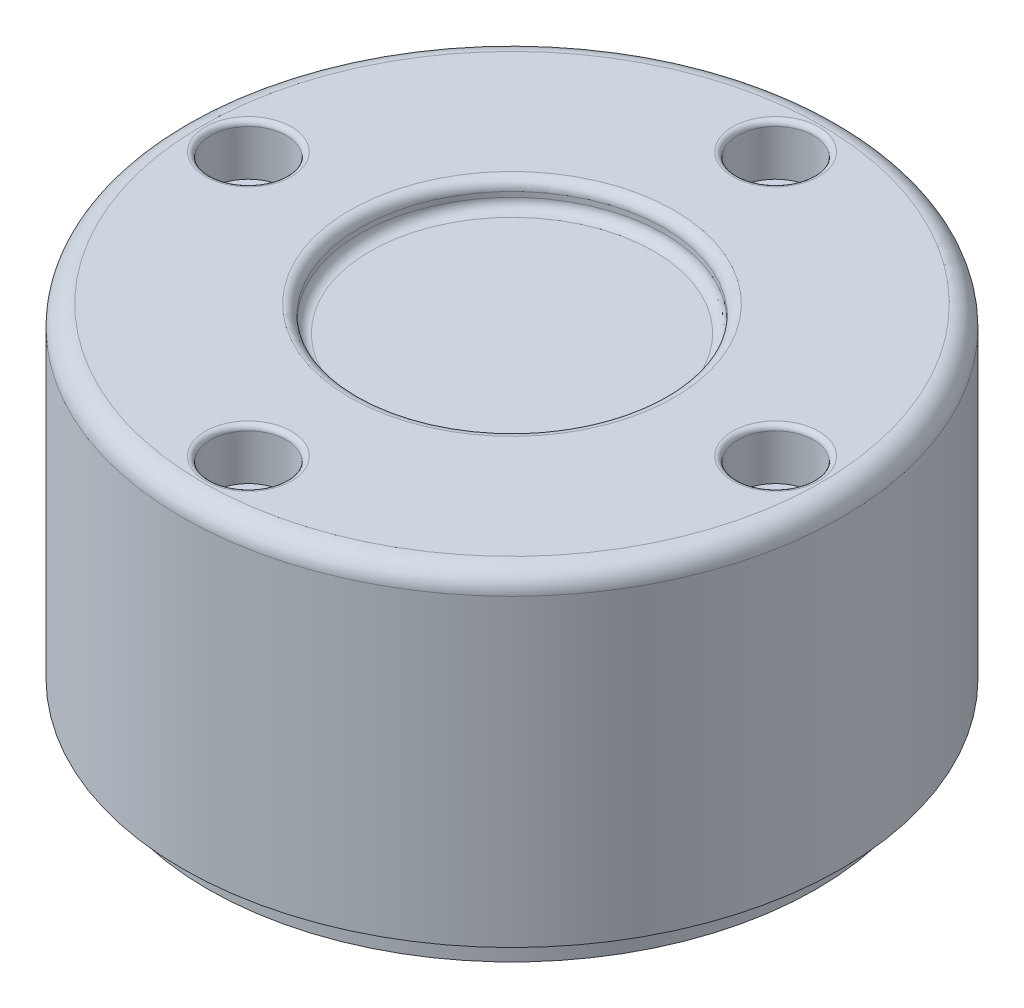
ISO-10303-21;
HEADER;
FILE_DESCRIPTION(('STEP AP214'),'2;1');
FILE_NAME('part.step','',(''),(''),'','','');
FILE_SCHEMA(('AUTOMOTIVE_DESIGN { 1 0 10303 214 1 1 1 1 }'));
ENDSEC;
DATA;
#1=APPLICATION_CONTEXT('core data for automotive mechanical design processes');
#2=APPLICATION_PROTOCOL_DEFINITION('international standard','automotive_design',2000,#1);
#3=PRODUCT_CONTEXT('',#1,'mechanical');
#4=PRODUCT('Part','Part','',(#3));
#5=PRODUCT_RELATED_PRODUCT_CATEGORY('part','',(#4));
#6=PRODUCT_DEFINITION_FORMATION('','',#4);
#7=PRODUCT_DEFINITION_CONTEXT('part definition',#1,'design');
#8=PRODUCT_DEFINITION('design','',#6,#7);
#9=PRODUCT_DEFINITION_SHAPE('','',#8);
#10=(LENGTH_UNIT() NAMED_UNIT(*) SI_UNIT(.MILLI.,.METRE.));
#11=(NAMED_UNIT(*) PLANE_ANGLE_UNIT() SI_UNIT($,.RADIAN.));
#12=(NAMED_UNIT(*) SI_UNIT($,.STERADIAN.) SOLID_ANGLE_UNIT());
#13=UNCERTAINTY_MEASURE_WITH_UNIT(LENGTH_MEASURE(1.E-05),#10,'distance_accuracy_value','');
#14=(GEOMETRIC_REPRESENTATION_CONTEXT(3) GLOBAL_UNCERTAINTY_ASSIGNED_CONTEXT((#13)) GLOBAL_UNIT_ASSIGNED_CONTEXT((#10,
#11,#12)) REPRESENTATION_CONTEXT('',''));
#15=CARTESIAN_POINT('',(0.,0.,0.));
#16=DIRECTION('',(0.,0.,1.));
#17=DIRECTION('',(1.,0.,0.));
#18=AXIS2_PLACEMENT_3D('',#15,#16,#17);
#19=CARTESIAN_POINT('',(0.,3.,0.));
#20=DIRECTION('',(0.,-1.,0.));
#21=DIRECTION('',(0.,0.,-1.));
#22=AXIS2_PLACEMENT_3D('',#19,#20,#21);
#23=CYLINDRICAL_SURFACE('',#22,30.);
#24=CARTESIAN_POINT('',(0.,3.,0.));
#25=DIRECTION('',(0.,1.,0.));
#26=DIRECTION('',(0.,0.,1.));
#27=AXIS2_PLACEMENT_3D('',#24,#25,#26);
#28=CIRCLE('',#27,30.);
#29=CARTESIAN_POINT('',(0.,3.,30.));
#30=VERTEX_POINT('',#29);
#31=EDGE_CURVE('E80',#30,#30,#28,.T.);
#32=ORIENTED_EDGE('',*,*,#31,.F.);
#33=EDGE_LOOP('',(#32));
#34=FACE_BOUND('',#33,.T.);
#35=CARTESIAN_POINT('',(0.,0.,0.));
#36=DIRECTION('',(0.,1.,0.));
#37=DIRECTION('',(0.,0.,1.));
#38=AXIS2_PLACEMENT_3D('',#35,#36,#37);
#39=CIRCLE('',#38,30.);
#40=CARTESIAN_POINT('',(0.,0.,30.));
#41=VERTEX_POINT('',#40);
#42=EDGE_CURVE('E81',#41,#41,#39,.T.);
#43=ORIENTED_EDGE('',*,*,#42,.T.);
#44=EDGE_LOOP('',(#43));
#45=FACE_BOUND('',#44,.T.);
#46=ADVANCED_FACE('F30',(#34,#45),#23,.T.);
#47=CARTESIAN_POINT('',(0.,0.,0.));
#48=DIRECTION('',(0.,1.,0.));
#49=DIRECTION('',(0.,0.,1.));
#50=AXIS2_PLACEMENT_3D('',#47,#48,#49);
#51=PLANE('',#50);
#52=ORIENTED_EDGE('',*,*,#42,.F.);
#53=EDGE_LOOP('',(#52));
#54=FACE_BOUND('',#53,.T.);
#55=ADVANCED_FACE('F119',(#54),#51,.F.);
#56=CARTESIAN_POINT('',(0.,35.,0.));
#57=DIRECTION('',(0.,-1.,0.));
#58=DIRECTION('',(0.,0.,-1.));
#59=AXIS2_PLACEMENT_3D('',#56,#57,#58);
#60=CYLINDRICAL_SURFACE('',#59,32.5);
#61=CARTESIAN_POINT('',(0.,33.,0.));
#62=DIRECTION('',(0.,1.,0.));
#63=DIRECTION('',(0.,0.,1.));
#64=AXIS2_PLACEMENT_3D('',#61,#62,#63);
#65=CIRCLE('',#64,32.5);
#66=CARTESIAN_POINT('',(0.,33.,32.5));
#67=VERTEX_POINT('',#66);
#68=EDGE_CURVE('E62',#67,#67,#65,.F.);
#69=ORIENTED_EDGE('',*,*,#68,.T.);
#70=EDGE_LOOP('',(#69));
#71=FACE_BOUND('',#70,.T.);
#72=CARTESIAN_POINT('',(0.,3.,0.));
#73=DIRECTION('',(0.,1.,0.));
#74=DIRECTION('',(0.,0.,1.));
#75=AXIS2_PLACEMENT_3D('',#72,#73,#74);
#76=CIRCLE('',#75,32.5);
#77=CARTESIAN_POINT('',(0.,3.,32.5));
#78=VERTEX_POINT('',#77);
#79=EDGE_CURVE('E84',#78,#78,#76,.T.);
#80=ORIENTED_EDGE('',*,*,#79,.T.);
#81=EDGE_LOOP('',(#80));
#82=FACE_BOUND('',#81,.T.);
#83=ADVANCED_FACE('F125',(#71,#82),#60,.T.);
#84=CARTESIAN_POINT('',(0.,35.,0.));
#85=DIRECTION('',(0.,1.,0.));
#86=DIRECTION('',(0.,0.,1.));
#87=AXIS2_PLACEMENT_3D('',#84,#85,#86);
#88=PLANE('',#87);
#89=CARTESIAN_POINT('',(26.,35.,0.));
#90=DIRECTION('',(0.,1.,0.));
#91=DIRECTION('',(0.,0.,1.));
#92=AXIS2_PLACEMENT_3D('',#89,#90,#91);
#93=CIRCLE('',#92,4.25);
#94=CARTESIAN_POINT('',(26.,35.,4.25));
#95=VERTEX_POINT('',#94);
#96=EDGE_CURVE('E45',#95,#95,#93,.F.);
#97=ORIENTED_EDGE('',*,*,#96,.T.);
#98=EDGE_LOOP('',(#97));
#99=FACE_BOUND('',#98,.T.);
#100=CARTESIAN_POINT('',(0.,35.,-26.));
#101=DIRECTION('',(0.,1.,0.));
#102=DIRECTION('',(0.,0.,1.));
#103=AXIS2_PLACEMENT_3D('',#100,#101,#102);
#104=CIRCLE('',#103,4.25);
#105=CARTESIAN_POINT('',(0.,35.,-21.75));
#106=VERTEX_POINT('',#105);
#107=EDGE_CURVE('E50',#106,#106,#104,.F.);
#108=ORIENTED_EDGE('',*,*,#107,.T.);
#109=EDGE_LOOP('',(#108));
#110=FACE_BOUND('',#109,.T.);
#111=CARTESIAN_POINT('',(-26.,35.,0.));
#112=DIRECTION('',(0.,1.,0.));
#113=DIRECTION('',(0.,0.,1.));
#114=AXIS2_PLACEMENT_3D('',#111,#112,#113);
#115=CIRCLE('',#114,4.25);
#116=CARTESIAN_POINT('',(-26.,35.,4.25000000000001));
#117=VERTEX_POINT('',#116);
#118=EDGE_CURVE('E53',#117,#117,#115,.F.);
#119=ORIENTED_EDGE('',*,*,#118,.T.);
#120=EDGE_LOOP('',(#119));
#121=FACE_BOUND('',#120,.T.);
#122=CARTESIAN_POINT('',(0.,35.,26.));
#123=DIRECTION('',(0.,1.,0.));
#124=DIRECTION('',(0.,0.,1.));
#125=AXIS2_PLACEMENT_3D('',#122,#123,#124);
#126=CIRCLE('',#125,4.25000000000001);
#127=CARTESIAN_POINT('',(0.,35.,30.25));
#128=VERTEX_POINT('',#127);
#129=EDGE_CURVE('E56',#128,#128,#126,.F.);
#130=ORIENTED_EDGE('',*,*,#129,.T.);
#131=EDGE_LOOP('',(#130));
#132=FACE_BOUND('',#131,.T.);
#133=CARTESIAN_POINT('',(0.,35.,0.));
#134=DIRECTION('',(0.,1.,0.));
#135=DIRECTION('',(0.,0.,1.));
#136=AXIS2_PLACEMENT_3D('',#133,#134,#135);
#137=CIRCLE('',#136,30.5);
#138=CARTESIAN_POINT('',(0.,35.,30.5));
#139=VERTEX_POINT('',#138);
#140=EDGE_CURVE('E65',#139,#139,#137,.T.);
#141=ORIENTED_EDGE('',*,*,#140,.T.);
#142=EDGE_LOOP('',(#141));
#143=FACE_BOUND('',#142,.T.);
#144=CARTESIAN_POINT('',(0.,35.,0.));
#145=DIRECTION('',(0.,1.,0.));
#146=DIRECTION('',(0.,0.,1.));
#147=AXIS2_PLACEMENT_3D('',#144,#145,#146);
#148=CIRCLE('',#147,16.);
#149=CARTESIAN_POINT('',(0.,35.,16.));
#150=VERTEX_POINT('',#149);
#151=EDGE_CURVE('E68',#150,#150,#148,.F.);
#152=ORIENTED_EDGE('',*,*,#151,.T.);
#153=EDGE_LOOP('',(#152));
#154=FACE_BOUND('',#153,.T.);
#155=ADVANCED_FACE('F160',(#99,#110,#121,#132,#143,#154),#88,.T.);
#156=CARTESIAN_POINT('',(0.,3.,0.));
#157=DIRECTION('',(0.,1.,0.));
#158=DIRECTION('',(0.,0.,1.));
#159=AXIS2_PLACEMENT_3D('',#156,#157,#158);
#160=PLANE('',#159);
#161=ORIENTED_EDGE('',*,*,#31,.T.);
#162=EDGE_LOOP('',(#161));
#163=FACE_BOUND('',#162,.T.);
#164=ORIENTED_EDGE('',*,*,#79,.F.);
#165=EDGE_LOOP('',(#164));
#166=FACE_BOUND('',#165,.T.);
#167=ADVANCED_FACE('F163',(#163,#166),#160,.F.);
#168=CARTESIAN_POINT('',(0.,32.5,0.));
#169=DIRECTION('',(0.,1.,0.));
#170=DIRECTION('',(0.,0.,1.));
#171=AXIS2_PLACEMENT_3D('',#168,#169,#170);
#172=CYLINDRICAL_SURFACE('',#171,15.);
#173=CARTESIAN_POINT('',(0.,34.,0.));
#174=DIRECTION('',(0.,1.,0.));
#175=DIRECTION('',(0.,0.,1.));
#176=AXIS2_PLACEMENT_3D('',#173,#174,#175);
#177=CIRCLE('',#176,15.);
#178=CARTESIAN_POINT('',(0.,34.,15.));
#179=VERTEX_POINT('',#178);
#180=EDGE_CURVE('E71',#179,#179,#177,.T.);
#181=ORIENTED_EDGE('',*,*,#180,.T.);
#182=EDGE_LOOP('',(#181));
#183=FACE_BOUND('',#182,.T.);
#184=CARTESIAN_POINT('',(0.,33.5,0.));
#185=DIRECTION('',(0.,1.,0.));
#186=DIRECTION('',(0.,0.,1.));
#187=AXIS2_PLACEMENT_3D('',#184,#185,#186);
#188=CIRCLE('',#187,15.);
#189=CARTESIAN_POINT('',(0.,33.5,15.));
#190=VERTEX_POINT('',#189);
#191=EDGE_CURVE('E74',#190,#190,#188,.F.);
#192=ORIENTED_EDGE('',*,*,#191,.T.);
#193=EDGE_LOOP('',(#192));
#194=FACE_BOUND('',#193,.T.);
#195=ADVANCED_FACE('F174',(#183,#194),#172,.F.);
#196=CARTESIAN_POINT('',(0.,32.5,0.));
#197=DIRECTION('',(0.,1.,0.));
#198=DIRECTION('',(0.,0.,1.));
#199=AXIS2_PLACEMENT_3D('',#196,#197,#198);
#200=PLANE('',#199);
#201=CARTESIAN_POINT('',(0.,32.5,0.));
#202=DIRECTION('',(0.,1.,0.));
#203=DIRECTION('',(0.,0.,1.));
#204=AXIS2_PLACEMENT_3D('',#201,#202,#203);
#205=CIRCLE('',#204,14.);
#206=CARTESIAN_POINT('',(0.,32.5,14.));
#207=VERTEX_POINT('',#206);
#208=EDGE_CURVE('E77',#207,#207,#205,.T.);
#209=ORIENTED_EDGE('',*,*,#208,.T.);
#210=EDGE_LOOP('',(#209));
#211=FACE_BOUND('',#210,.T.);
#212=ADVANCED_FACE('F177',(#211),#200,.T.);
#213=CARTESIAN_POINT('',(-26.,30.,0.));
#214=DIRECTION('',(0.,1.,0.));
#215=DIRECTION('',(0.,0.,1.));
#216=AXIS2_PLACEMENT_3D('',#213,#214,#215);
#217=CYLINDRICAL_SURFACE('',#216,3.75);
#218=CARTESIAN_POINT('',(-26.,34.5,0.));
#219=DIRECTION('',(0.,1.,0.));
#220=DIRECTION('',(0.,0.,1.));
#221=AXIS2_PLACEMENT_3D('',#218,#219,#220);
#222=CIRCLE('',#221,3.75);
#223=CARTESIAN_POINT('',(-26.,34.5,3.75));
#224=VERTEX_POINT('',#223);
#225=EDGE_CURVE('E37',#224,#224,#222,.T.);
#226=ORIENTED_EDGE('',*,*,#225,.T.);
#227=EDGE_LOOP('',(#226));
#228=FACE_BOUND('',#227,.T.);
#229=CARTESIAN_POINT('',(-26.,30.,0.));
#230=DIRECTION('',(0.,1.,0.));
#231=DIRECTION('',(0.,0.,1.));
#232=AXIS2_PLACEMENT_3D('',#229,#230,#231);
#233=CIRCLE('',#232,3.75);
#234=CARTESIAN_POINT('',(-26.,30.,3.75));
#235=VERTEX_POINT('',#234);
#236=EDGE_CURVE('E89',#235,#235,#233,.T.);
#237=ORIENTED_EDGE('',*,*,#236,.F.);
#238=EDGE_LOOP('',(#237));
#239=FACE_BOUND('',#238,.T.);
#240=ADVANCED_FACE('F184',(#228,#239),#217,.F.);
#241=CARTESIAN_POINT('',(0.,30.,0.));
#242=DIRECTION('',(0.,1.,0.));
#243=DIRECTION('',(0.,0.,1.));
#244=AXIS2_PLACEMENT_3D('',#241,#242,#243);
#245=PLANE('',#244);
#246=ORIENTED_EDGE('',*,*,#236,.T.);
#247=EDGE_LOOP('',(#246));
#248=FACE_BOUND('',#247,.T.);
#249=ADVANCED_FACE('F189',(#248),#245,.T.);
#250=CARTESIAN_POINT('',(0.,30.,26.));
#251=DIRECTION('',(0.,1.,0.));
#252=DIRECTION('',(0.,0.,1.));
#253=AXIS2_PLACEMENT_3D('',#250,#251,#252);
#254=CYLINDRICAL_SURFACE('',#253,3.75000000000001);
#255=CARTESIAN_POINT('',(0.,34.5,26.));
#256=DIRECTION('',(0.,1.,0.));
#257=DIRECTION('',(0.,0.,1.));
#258=AXIS2_PLACEMENT_3D('',#255,#256,#257);
#259=CIRCLE('',#258,3.75000000000001);
#260=CARTESIAN_POINT('',(0.,34.5,29.75));
#261=VERTEX_POINT('',#260);
#262=EDGE_CURVE('E10',#261,#261,#259,.T.);
#263=ORIENTED_EDGE('',*,*,#262,.T.);
#264=EDGE_LOOP('',(#263));
#265=FACE_BOUND('',#264,.T.);
#266=CARTESIAN_POINT('',(0.,30.,26.));
#267=DIRECTION('',(0.,1.,0.));
#268=DIRECTION('',(0.,0.,1.));
#269=AXIS2_PLACEMENT_3D('',#266,#267,#268);
#270=CIRCLE('',#269,3.75000000000001);
#271=CARTESIAN_POINT('',(0.,30.,29.75));
#272=VERTEX_POINT('',#271);
#273=EDGE_CURVE('E93',#272,#272,#270,.T.);
#274=ORIENTED_EDGE('',*,*,#273,.F.);
#275=EDGE_LOOP('',(#274));
#276=FACE_BOUND('',#275,.T.);
#277=ADVANCED_FACE('F282',(#265,#276),#254,.F.);
#278=CARTESIAN_POINT('',(0.,30.,26.));
#279=DIRECTION('',(0.,1.,0.));
#280=DIRECTION('',(0.,0.,1.));
#281=AXIS2_PLACEMENT_3D('',#278,#279,#280);
#282=PLANE('',#281);
#283=ORIENTED_EDGE('',*,*,#273,.T.);
#284=EDGE_LOOP('',(#283));
#285=FACE_BOUND('',#284,.T.);
#286=ADVANCED_FACE('F274',(#285),#282,.T.);
#287=CARTESIAN_POINT('',(26.,30.,0.));
#288=DIRECTION('',(0.,1.,0.));
#289=DIRECTION('',(0.,0.,1.));
#290=AXIS2_PLACEMENT_3D('',#287,#288,#289);
#291=CYLINDRICAL_SURFACE('',#290,3.75);
#292=CARTESIAN_POINT('',(26.,34.5,0.));
#293=DIRECTION('',(0.,1.,0.));
#294=DIRECTION('',(0.,0.,1.));
#295=AXIS2_PLACEMENT_3D('',#292,#293,#294);
#296=CIRCLE('',#295,3.75);
#297=CARTESIAN_POINT('',(26.,34.5,3.75));
#298=VERTEX_POINT('',#297);
#299=EDGE_CURVE('E59',#298,#298,#296,.T.);
#300=ORIENTED_EDGE('',*,*,#299,.T.);
#301=EDGE_LOOP('',(#300));
#302=FACE_BOUND('',#301,.T.);
#303=CARTESIAN_POINT('',(26.,30.,0.));
#304=DIRECTION('',(0.,1.,0.));
#305=DIRECTION('',(0.,0.,1.));
#306=AXIS2_PLACEMENT_3D('',#303,#304,#305);
#307=CIRCLE('',#306,3.75);
#308=CARTESIAN_POINT('',(26.,30.,3.75));
#309=VERTEX_POINT('',#308);
#310=EDGE_CURVE('E96',#309,#309,#307,.T.);
#311=ORIENTED_EDGE('',*,*,#310,.F.);
#312=EDGE_LOOP('',(#311));
#313=FACE_BOUND('',#312,.T.);
#314=ADVANCED_FACE('F115',(#302,#313),#291,.F.);
#315=CARTESIAN_POINT('',(0.,30.,0.));
#316=DIRECTION('',(0.,1.,0.));
#317=DIRECTION('',(0.,0.,1.));
#318=AXIS2_PLACEMENT_3D('',#315,#316,#317);
#319=PLANE('',#318);
#320=ORIENTED_EDGE('',*,*,#310,.T.);
#321=EDGE_LOOP('',(#320));
#322=FACE_BOUND('',#321,.T.);
#323=ADVANCED_FACE('F106',(#322),#319,.T.);
#324=CARTESIAN_POINT('',(0.,30.,-26.));
#325=DIRECTION('',(0.,1.,0.));
#326=DIRECTION('',(0.,0.,1.));
#327=AXIS2_PLACEMENT_3D('',#324,#325,#326);
#328=CYLINDRICAL_SURFACE('',#327,3.75);
#329=CARTESIAN_POINT('',(0.,34.5,-26.));
#330=DIRECTION('',(0.,1.,0.));
#331=DIRECTION('',(0.,0.,1.));
#332=AXIS2_PLACEMENT_3D('',#329,#330,#331);
#333=CIRCLE('',#332,3.75);
#334=CARTESIAN_POINT('',(0.,34.5,-22.25));
#335=VERTEX_POINT('',#334);
#336=EDGE_CURVE('E41',#335,#335,#333,.T.);
#337=ORIENTED_EDGE('',*,*,#336,.T.);
#338=EDGE_LOOP('',(#337));
#339=FACE_BOUND('',#338,.T.);
#340=CARTESIAN_POINT('',(0.,30.,-26.));
#341=DIRECTION('',(0.,1.,0.));
#342=DIRECTION('',(0.,0.,1.));
#343=AXIS2_PLACEMENT_3D('',#340,#341,#342);
#344=CIRCLE('',#343,3.75);
#345=CARTESIAN_POINT('',(0.,30.,-22.25));
#346=VERTEX_POINT('',#345);
#347=EDGE_CURVE('E92',#346,#346,#344,.T.);
#348=ORIENTED_EDGE('',*,*,#347,.F.);
#349=EDGE_LOOP('',(#348));
#350=FACE_BOUND('',#349,.T.);
#351=ADVANCED_FACE('F104',(#339,#350),#328,.F.);
#352=CARTESIAN_POINT('',(0.,30.,0.));
#353=DIRECTION('',(0.,1.,0.));
#354=DIRECTION('',(0.,0.,1.));
#355=AXIS2_PLACEMENT_3D('',#352,#353,#354);
#356=PLANE('',#355);
#357=ORIENTED_EDGE('',*,*,#347,.T.);
#358=EDGE_LOOP('',(#357));
#359=FACE_BOUND('',#358,.T.);
#360=ADVANCED_FACE('F102',(#359),#356,.T.);
#361=CARTESIAN_POINT('',(0.,33.5,0.));
#362=DIRECTION('',(0.,1.,0.));
#363=DIRECTION('',(0.,0.,1.));
#364=AXIS2_PLACEMENT_3D('',#361,#362,#363);
#365=TOROIDAL_SURFACE('',#364,14.,1.);
#366=ORIENTED_EDGE('',*,*,#191,.F.);
#367=EDGE_LOOP('',(#366));
#368=FACE_BOUND('',#367,.T.);
#369=ORIENTED_EDGE('',*,*,#208,.F.);
#370=EDGE_LOOP('',(#369));
#371=FACE_BOUND('',#370,.T.);
#372=ADVANCED_FACE('F113',(#368,#371),#365,.F.);
#373=CARTESIAN_POINT('',(0.,34.,0.));
#374=DIRECTION('',(0.,1.,0.));
#375=DIRECTION('',(0.,0.,1.));
#376=AXIS2_PLACEMENT_3D('',#373,#374,#375);
#377=TOROIDAL_SURFACE('',#376,16.,1.);
#378=ORIENTED_EDGE('',*,*,#151,.F.);
#379=EDGE_LOOP('',(#378));
#380=FACE_BOUND('',#379,.T.);
#381=ORIENTED_EDGE('',*,*,#180,.F.);
#382=EDGE_LOOP('',(#381));
#383=FACE_BOUND('',#382,.T.);
#384=ADVANCED_FACE('F134',(#380,#383),#377,.T.);
#385=CARTESIAN_POINT('',(0.,33.,0.));
#386=DIRECTION('',(0.,1.,0.));
#387=DIRECTION('',(0.,0.,1.));
#388=AXIS2_PLACEMENT_3D('',#385,#386,#387);
#389=TOROIDAL_SURFACE('',#388,30.5,2.);
#390=ORIENTED_EDGE('',*,*,#68,.F.);
#391=EDGE_LOOP('',(#390));
#392=FACE_BOUND('',#391,.T.);
#393=ORIENTED_EDGE('',*,*,#140,.F.);
#394=EDGE_LOOP('',(#393));
#395=FACE_BOUND('',#394,.T.);
#396=ADVANCED_FACE('F138',(#392,#395),#389,.T.);
#397=CARTESIAN_POINT('',(26.,34.5,0.));
#398=DIRECTION('',(0.,1.,0.));
#399=DIRECTION('',(0.,0.,1.));
#400=AXIS2_PLACEMENT_3D('',#397,#398,#399);
#401=TOROIDAL_SURFACE('',#400,4.25,0.5);
#402=ORIENTED_EDGE('',*,*,#96,.F.);
#403=EDGE_LOOP('',(#402));
#404=FACE_BOUND('',#403,.T.);
#405=ORIENTED_EDGE('',*,*,#299,.F.);
#406=EDGE_LOOP('',(#405));
#407=FACE_BOUND('',#406,.T.);
#408=ADVANCED_FACE('F142',(#404,#407),#401,.T.);
#409=CARTESIAN_POINT('',(0.,34.5,-26.));
#410=DIRECTION('',(0.,1.,0.));
#411=DIRECTION('',(0.,0.,1.));
#412=AXIS2_PLACEMENT_3D('',#409,#410,#411);
#413=TOROIDAL_SURFACE('',#412,4.25,0.5);
#414=ORIENTED_EDGE('',*,*,#107,.F.);
#415=EDGE_LOOP('',(#414));
#416=FACE_BOUND('',#415,.T.);
#417=ORIENTED_EDGE('',*,*,#336,.F.);
#418=EDGE_LOOP('',(#417));
#419=FACE_BOUND('',#418,.T.);
#420=ADVANCED_FACE('F146',(#416,#419),#413,.T.);
#421=CARTESIAN_POINT('',(-26.,34.5,0.));
#422=DIRECTION('',(0.,1.,0.));
#423=DIRECTION('',(0.,0.,1.));
#424=AXIS2_PLACEMENT_3D('',#421,#422,#423);
#425=TOROIDAL_SURFACE('',#424,4.25,0.5);
#426=ORIENTED_EDGE('',*,*,#118,.F.);
#427=EDGE_LOOP('',(#426));
#428=FACE_BOUND('',#427,.T.);
#429=ORIENTED_EDGE('',*,*,#225,.F.);
#430=EDGE_LOOP('',(#429));
#431=FACE_BOUND('',#430,.T.);
#432=ADVANCED_FACE('F149',(#428,#431),#425,.T.);
#433=CARTESIAN_POINT('',(0.,34.5,26.));
#434=DIRECTION('',(0.,1.,0.));
#435=DIRECTION('',(0.,0.,1.));
#436=AXIS2_PLACEMENT_3D('',#433,#434,#435);
#437=TOROIDAL_SURFACE('',#436,4.25000000000001,0.5);
#438=ORIENTED_EDGE('',*,*,#129,.F.);
#439=EDGE_LOOP('',(#438));
#440=FACE_BOUND('',#439,.T.);
#441=ORIENTED_EDGE('',*,*,#262,.F.);
#442=EDGE_LOOP('',(#441));
#443=FACE_BOUND('',#442,.T.);
#444=ADVANCED_FACE('F32',(#440,#443),#437,.T.);
#445=CLOSED_SHELL('',(#46,#55,#83,#155,#167,#195,#212,#240,#249,#277,#286,#314,#323,#351,#360,
#372,#384,#396,#408,#420,#432,#444));
#446=MANIFOLD_SOLID_BREP('B2',#445);
#447=ADVANCED_BREP_SHAPE_REPRESENTATION('',(#18,#446),#14);
#448=SHAPE_DEFINITION_REPRESENTATION(#9,#447);
ENDSEC;
END-ISO-10303-21;
